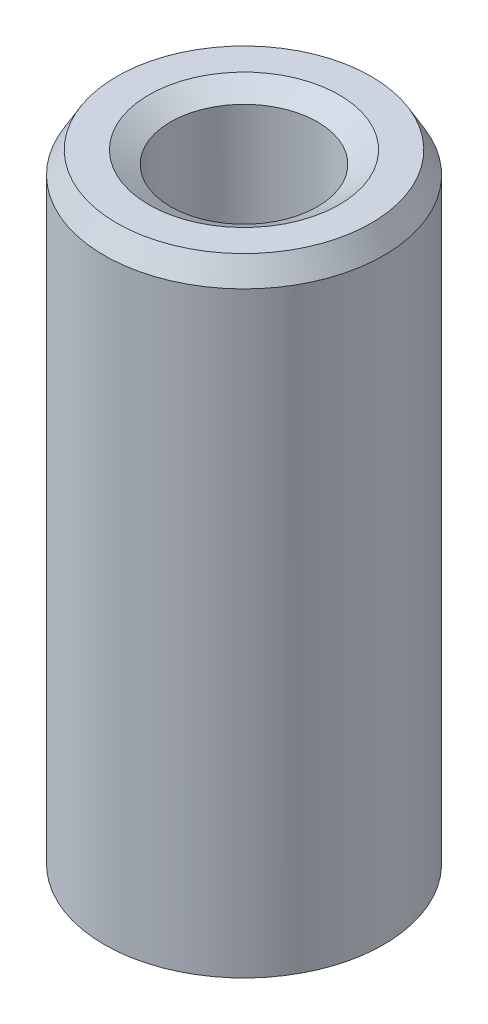
ISO-10303-21;
HEADER;
FILE_DESCRIPTION(('STEP AP214'),'2;1');
FILE_NAME('part.step','',(''),(''),'','','');
FILE_SCHEMA(('AUTOMOTIVE_DESIGN { 1 0 10303 214 1 1 1 1 }'));
ENDSEC;
DATA;
#1=APPLICATION_CONTEXT('core data for automotive mechanical design processes');
#2=APPLICATION_PROTOCOL_DEFINITION('international standard','automotive_design',2000,#1);
#3=PRODUCT_CONTEXT('',#1,'mechanical');
#4=PRODUCT('Part','Part','',(#3));
#5=PRODUCT_RELATED_PRODUCT_CATEGORY('part','',(#4));
#6=PRODUCT_DEFINITION_FORMATION('','',#4);
#7=PRODUCT_DEFINITION_CONTEXT('part definition',#1,'design');
#8=PRODUCT_DEFINITION('design','',#6,#7);
#9=PRODUCT_DEFINITION_SHAPE('','',#8);
#10=(LENGTH_UNIT() NAMED_UNIT(*) SI_UNIT(.MILLI.,.METRE.));
#11=(NAMED_UNIT(*) PLANE_ANGLE_UNIT() SI_UNIT($,.RADIAN.));
#12=(NAMED_UNIT(*) SI_UNIT($,.STERADIAN.) SOLID_ANGLE_UNIT());
#13=UNCERTAINTY_MEASURE_WITH_UNIT(LENGTH_MEASURE(1.E-05),#10,'distance_accuracy_value','');
#14=(GEOMETRIC_REPRESENTATION_CONTEXT(3) GLOBAL_UNCERTAINTY_ASSIGNED_CONTEXT((#13)) GLOBAL_UNIT_ASSIGNED_CONTEXT((#10,
#11,#12)) REPRESENTATION_CONTEXT('',''));
#15=CARTESIAN_POINT('',(0.,0.,0.));
#16=DIRECTION('',(0.,0.,1.));
#17=DIRECTION('',(1.,0.,0.));
#18=AXIS2_PLACEMENT_3D('',#15,#16,#17);
#19=CARTESIAN_POINT('',(0.,112.929822923321,0.));
#20=DIRECTION('',(0.,-1.,0.));
#21=DIRECTION('',(0.,0.,-1.));
#22=AXIS2_PLACEMENT_3D('',#19,#20,#21);
#23=CYLINDRICAL_SURFACE('',#22,25.);
#24=CARTESIAN_POINT('',(0.,2.24499833424635,0.));
#25=DIRECTION('',(0.,1.,0.));
#26=DIRECTION('',(0.,0.,1.));
#27=AXIS2_PLACEMENT_3D('',#24,#25,#26);
#28=CIRCLE('',#27,25.);
#29=CARTESIAN_POINT('',(0.,2.24499833424634,-25.));
#30=VERTEX_POINT('',#29);
#31=EDGE_CURVE('E10',#30,#30,#28,.T.);
#32=CARTESIAN_POINT('',(0.,109.041371745499,0.));
#33=DIRECTION('',(0.,1.,0.));
#34=DIRECTION('',(0.,0.,1.));
#35=AXIS2_PLACEMENT_3D('',#32,#33,#34);
#36=CIRCLE('',#35,25.);
#37=CARTESIAN_POINT('',(0.,109.041371745499,-25.));
#38=VERTEX_POINT('',#37);
#39=EDGE_CURVE('E50',#38,#38,#36,.F.);
#40=CARTESIAN_POINT('',(0.,2.24499833424634,-25.));
#41=CARTESIAN_POINT('',(0.,3.35746055728022,-25.));
#42=CARTESIAN_POINT('',(0.,4.4699227803141,-25.));
#43=CARTESIAN_POINT('',(0.,6.69484722638187,-25.));
#44=CARTESIAN_POINT('',(0.,7.80730944941575,-25.));
#45=CARTESIAN_POINT('',(0.,10.0322338954835,-25.));
#46=CARTESIAN_POINT('',(0.,11.1446961185174,-25.));
#47=CARTESIAN_POINT('',(0.,13.3696205645852,-25.));
#48=CARTESIAN_POINT('',(0.,14.482082787619,-25.));
#49=CARTESIAN_POINT('',(0.,16.7070072336868,-25.));
#50=CARTESIAN_POINT('',(0.,17.8194694567207,-25.));
#51=CARTESIAN_POINT('',(0.,20.0443939027885,-25.));
#52=CARTESIAN_POINT('',(0.,21.1568561258223,-25.));
#53=CARTESIAN_POINT('',(0.,23.3817805718901,-25.));
#54=CARTESIAN_POINT('',(0.,24.494242794924,-25.));
#55=CARTESIAN_POINT('',(0.,26.7191672409918,-25.));
#56=CARTESIAN_POINT('',(0.,27.8316294640256,-25.));
#57=CARTESIAN_POINT('',(0.,30.0565539100934,-25.));
#58=CARTESIAN_POINT('',(0.,31.1690161331273,-25.));
#59=CARTESIAN_POINT('',(0.,33.3939405791951,-25.));
#60=CARTESIAN_POINT('',(0.,34.5064028022289,-25.));
#61=CARTESIAN_POINT('',(0.,36.7313272482967,-25.));
#62=CARTESIAN_POINT('',(0.,37.8437894713306,-25.));
#63=CARTESIAN_POINT('',(0.,40.0687139173983,-25.));
#64=CARTESIAN_POINT('',(0.,41.1811761404322,-25.));
#65=CARTESIAN_POINT('',(0.,43.4061005865,-25.));
#66=CARTESIAN_POINT('',(0.,44.5185628095339,-25.));
#67=CARTESIAN_POINT('',(0.,46.7434872556016,-25.));
#68=CARTESIAN_POINT('',(0.,47.8559494786355,-25.));
#69=CARTESIAN_POINT('',(0.,50.0808739247033,-25.));
#70=CARTESIAN_POINT('',(0.,51.1933361477372,-25.));
#71=CARTESIAN_POINT('',(0.,53.4182605938049,-25.));
#72=CARTESIAN_POINT('',(0.,54.5307228168388,-25.));
#73=CARTESIAN_POINT('',(0.,56.7556472629066,-25.));
#74=CARTESIAN_POINT('',(0.,57.8681094859405,-25.));
#75=CARTESIAN_POINT('',(0.,60.0930339320082,-25.));
#76=CARTESIAN_POINT('',(0.,61.2054961550421,-25.));
#77=CARTESIAN_POINT('',(0.,63.4304206011099,-25.));
#78=CARTESIAN_POINT('',(0.,64.5428828241437,-25.));
#79=CARTESIAN_POINT('',(0.,66.7678072702115,-25.));
#80=CARTESIAN_POINT('',(0.,67.8802694932454,-25.));
#81=CARTESIAN_POINT('',(0.,70.1051939393132,-25.));
#82=CARTESIAN_POINT('',(0.,71.217656162347,-25.));
#83=CARTESIAN_POINT('',(0.,73.4425806084148,-25.));
#84=CARTESIAN_POINT('',(0.,74.5550428314487,-25.));
#85=CARTESIAN_POINT('',(0.,76.7799672775165,-25.));
#86=CARTESIAN_POINT('',(0.,77.8924295005503,-25.));
#87=CARTESIAN_POINT('',(0.,80.1173539466181,-25.));
#88=CARTESIAN_POINT('',(0.,81.229816169652,-25.));
#89=CARTESIAN_POINT('',(0.,83.4547406157198,-25.));
#90=CARTESIAN_POINT('',(0.,84.5672028387536,-25.));
#91=CARTESIAN_POINT('',(0.,86.7921272848214,-25.));
#92=CARTESIAN_POINT('',(0.,87.9045895078553,-25.));
#93=CARTESIAN_POINT('',(0.,90.1295139539231,-25.));
#94=CARTESIAN_POINT('',(0.,91.2419761769569,-25.));
#95=CARTESIAN_POINT('',(0.,93.4669006230247,-25.));
#96=CARTESIAN_POINT('',(0.,94.5793628460586,-25.));
#97=CARTESIAN_POINT('',(0.,96.8042872921263,-25.));
#98=CARTESIAN_POINT('',(0.,97.9167495151602,-25.));
#99=CARTESIAN_POINT('',(0.,100.141673961228,-25.));
#100=CARTESIAN_POINT('',(0.,101.254136184262,-25.));
#101=CARTESIAN_POINT('',(0.,103.47906063033,-25.));
#102=CARTESIAN_POINT('',(0.,104.591522853364,-25.));
#103=CARTESIAN_POINT('',(0.,106.816447299431,-25.));
#104=CARTESIAN_POINT('',(0.,107.928909522465,-25.));
#105=CARTESIAN_POINT('',(0.,109.041371745499,-25.));
#106=B_SPLINE_CURVE_WITH_KNOTS('',3,(#40,#41,#42,#43,#44,#45,#46,#47,#48,#49,#50,#51,#52,#53,
#54,#55,#56,#57,#58,#59,#60,#61,#62,#63,#64,#65,#66,#67,#68,#69,#70,#71,#72,#73,#74,#75,#76,#77,
#78,#79,#80,#81,#82,#83,#84,#85,#86,#87,#88,#89,#90,#91,#92,#93,#94,#95,#96,#97,#98,#99,#100,
#101,#102,#103,#104,#105),.UNSPECIFIED.,.F.,.F.,(4,2,2,2,2,2,2,2,2,2,2,2,2,2,2,2,2,2,2,2,2,2,2,
2,2,2,2,2,2,2,2,2,4),(0.,3.33738666910165,6.67477333820329,10.0121600073049,13.3495466764066,
16.6869333455082,20.0243200146099,23.3617066837115,26.6990933528132,30.0364800219148,
33.3738666910165,36.7112533601181,40.0486400292198,43.3860266983214,46.7234133674231,
50.0608000365247,53.3981867056264,56.735573374728,60.0729600438297,63.4103467129313,
66.7477333820329,70.0851200511346,73.4225067202362,76.7598933893379,80.0972800584395,
83.4346667275412,86.7720533966428,90.1094400657445,93.4468267348461,96.7842134039478,
100.121600073049,103.458986742151,106.796373411253),.UNSPECIFIED.);
#107=EDGE_CURVE('BSEAM39',#30,#38,#106,.T.);
#108=ORIENTED_EDGE('',*,*,#31,.T.);
#109=ORIENTED_EDGE('',*,*,#39,.T.);
#110=ORIENTED_EDGE('',*,*,#107,.T.);
#111=ORIENTED_EDGE('',*,*,#107,.F.);
#112=EDGE_LOOP('',(#108,#110,#109,#111));
#113=FACE_BOUND('',#112,.T.);
#114=ADVANCED_FACE('F39',(#113),#23,.T.);
#115=CARTESIAN_POINT('',(0.,112.929822923321,0.));
#116=DIRECTION('',(0.,1.,0.));
#117=DIRECTION('',(0.,0.,1.));
#118=AXIS2_PLACEMENT_3D('',#115,#116,#117);
#119=PLANE('',#118);
#120=CARTESIAN_POINT('',(0.,112.929822923321,0.));
#121=DIRECTION('',(0.,1.,0.));
#122=DIRECTION('',(0.,0.,1.));
#123=AXIS2_PLACEMENT_3D('',#120,#121,#122);
#124=CIRCLE('',#123,17.0359666515622);
#125=CARTESIAN_POINT('',(0.,112.929822923321,17.0359666515622));
#126=VERTEX_POINT('',#125);
#127=EDGE_CURVE('E58',#126,#126,#124,.F.);
#128=ORIENTED_EDGE('',*,*,#127,.T.);
#129=EDGE_LOOP('',(#128));
#130=FACE_BOUND('',#129,.T.);
#131=CARTESIAN_POINT('',(0.,112.929822923321,0.));
#132=DIRECTION('',(0.,1.,0.));
#133=DIRECTION('',(0.,0.,1.));
#134=AXIS2_PLACEMENT_3D('',#131,#132,#133);
#135=CIRCLE('',#134,22.7550016657538);
#136=CARTESIAN_POINT('',(0.,112.929822923321,22.7550016657538));
#137=VERTEX_POINT('',#136);
#138=EDGE_CURVE('E61',#137,#137,#135,.T.);
#139=ORIENTED_EDGE('',*,*,#138,.T.);
#140=EDGE_LOOP('',(#139));
#141=FACE_BOUND('',#140,.T.);
#142=ADVANCED_FACE('F88',(#130,#141),#119,.T.);
#143=CARTESIAN_POINT('',(0.,0.,0.));
#144=DIRECTION('',(0.,1.,0.));
#145=DIRECTION('',(0.,0.,1.));
#146=AXIS2_PLACEMENT_3D('',#143,#144,#145);
#147=PLANE('',#146);
#148=CARTESIAN_POINT('',(0.,0.,0.));
#149=DIRECTION('',(0.,1.,0.));
#150=DIRECTION('',(0.,0.,1.));
#151=AXIS2_PLACEMENT_3D('',#148,#149,#150);
#152=CIRCLE('',#151,15.3925138079863);
#153=CARTESIAN_POINT('',(0.,0.,15.3925138079863));
#154=VERTEX_POINT('',#153);
#155=EDGE_CURVE('E51',#154,#154,#152,.T.);
#156=ORIENTED_EDGE('',*,*,#155,.T.);
#157=EDGE_LOOP('',(#156));
#158=FACE_BOUND('',#157,.T.);
#159=CARTESIAN_POINT('',(0.,0.,0.));
#160=DIRECTION('',(0.,1.,0.));
#161=DIRECTION('',(0.,0.,1.));
#162=AXIS2_PLACEMENT_3D('',#159,#160,#161);
#163=CIRCLE('',#162,21.1115488221778);
#164=CARTESIAN_POINT('',(0.,0.,21.1115488221778));
#165=VERTEX_POINT('',#164);
#166=EDGE_CURVE('E54',#165,#165,#163,.F.);
#167=ORIENTED_EDGE('',*,*,#166,.T.);
#168=EDGE_LOOP('',(#167));
#169=FACE_BOUND('',#168,.T.);
#170=ADVANCED_FACE('F83',(#158,#169),#147,.F.);
#171=CARTESIAN_POINT('',(0.,112.929822923321,0.));
#172=DIRECTION('',(0.,-1.,0.));
#173=DIRECTION('',(0.,0.,-1.));
#174=AXIS2_PLACEMENT_3D('',#171,#172,#173);
#175=CYLINDRICAL_SURFACE('',#174,13.14751547374);
#176=CARTESIAN_POINT('',(0.,110.684824589075,0.));
#177=DIRECTION('',(0.,1.,0.));
#178=DIRECTION('',(0.,0.,1.));
#179=AXIS2_PLACEMENT_3D('',#176,#177,#178);
#180=CIRCLE('',#179,13.14751547374);
#181=CARTESIAN_POINT('',(0.,110.684824589075,-13.14751547374));
#182=VERTEX_POINT('',#181);
#183=EDGE_CURVE('E67',#182,#182,#180,.T.);
#184=CARTESIAN_POINT('',(0.,3.88845117782216,0.));
#185=DIRECTION('',(0.,1.,0.));
#186=DIRECTION('',(0.,0.,1.));
#187=AXIS2_PLACEMENT_3D('',#184,#185,#186);
#188=CIRCLE('',#187,13.14751547374);
#189=CARTESIAN_POINT('',(0.,3.88845117782215,-13.14751547374));
#190=VERTEX_POINT('',#189);
#191=EDGE_CURVE('E69',#190,#190,#188,.F.);
#192=CARTESIAN_POINT('',(0.,110.684824589075,-13.14751547374));
#193=CARTESIAN_POINT('',(0.,109.572362366041,-13.14751547374));
#194=CARTESIAN_POINT('',(0.,108.459900143007,-13.14751547374));
#195=CARTESIAN_POINT('',(0.,106.234975696939,-13.14751547374));
#196=CARTESIAN_POINT('',(0.,105.122513473905,-13.14751547374));
#197=CARTESIAN_POINT('',(0.,102.897589027838,-13.14751547374));
#198=CARTESIAN_POINT('',(0.,101.785126804804,-13.14751547374));
#199=CARTESIAN_POINT('',(0.,99.5602023587359,-13.14751547374));
#200=CARTESIAN_POINT('',(0.,98.447740135702,-13.14751547374));
#201=CARTESIAN_POINT('',(0.,96.2228156896343,-13.14751547374));
#202=CARTESIAN_POINT('',(0.,95.1103534666004,-13.14751547374));
#203=CARTESIAN_POINT('',(0.,92.8854290205326,-13.14751547374));
#204=CARTESIAN_POINT('',(0.,91.7729667974987,-13.14751547374));
#205=CARTESIAN_POINT('',(0.,89.548042351431,-13.14751547374));
#206=CARTESIAN_POINT('',(0.,88.4355801283971,-13.14751547374));
#207=CARTESIAN_POINT('',(0.,86.2106556823293,-13.14751547374));
#208=CARTESIAN_POINT('',(0.,85.0981934592954,-13.14751547374));
#209=CARTESIAN_POINT('',(0.,82.8732690132277,-13.14751547374));
#210=CARTESIAN_POINT('',(0.,81.7608067901938,-13.14751547374));
#211=CARTESIAN_POINT('',(0.,79.535882344126,-13.14751547374));
#212=CARTESIAN_POINT('',(0.,78.4234201210922,-13.14751547374));
#213=CARTESIAN_POINT('',(0.,76.1984956750244,-13.14751547374));
#214=CARTESIAN_POINT('',(0.,75.0860334519905,-13.14751547374));
#215=CARTESIAN_POINT('',(0.,72.8611090059228,-13.14751547374));
#216=CARTESIAN_POINT('',(0.,71.7486467828889,-13.14751547374));
#217=CARTESIAN_POINT('',(0.,69.5237223368211,-13.14751547374));
#218=CARTESIAN_POINT('',(0.,68.4112601137872,-13.14751547374));
#219=CARTESIAN_POINT('',(0.,66.1863356677195,-13.14751547374));
#220=CARTESIAN_POINT('',(0.,65.0738734446856,-13.14751547374));
#221=CARTESIAN_POINT('',(0.,62.8489489986178,-13.14751547374));
#222=CARTESIAN_POINT('',(0.,61.7364867755839,-13.14751547374));
#223=CARTESIAN_POINT('',(0.,59.5115623295162,-13.14751547374));
#224=CARTESIAN_POINT('',(0.,58.3991001064823,-13.14751547374));
#225=CARTESIAN_POINT('',(0.,56.1741756604145,-13.14751547374));
#226=CARTESIAN_POINT('',(0.,55.0617134373807,-13.14751547374));
#227=CARTESIAN_POINT('',(0.,52.8367889913129,-13.14751547374));
#228=CARTESIAN_POINT('',(0.,51.724326768279,-13.14751547374));
#229=CARTESIAN_POINT('',(0.,49.4994023222113,-13.14751547374));
#230=CARTESIAN_POINT('',(0.,48.3869400991774,-13.14751547374));
#231=CARTESIAN_POINT('',(0.,46.1620156531096,-13.14751547374));
#232=CARTESIAN_POINT('',(0.,45.0495534300757,-13.14751547374));
#233=CARTESIAN_POINT('',(0.,42.824628984008,-13.14751547374));
#234=CARTESIAN_POINT('',(0.,41.7121667609741,-13.14751547374));
#235=CARTESIAN_POINT('',(0.,39.4872423149063,-13.14751547374));
#236=CARTESIAN_POINT('',(0.,38.3747800918725,-13.14751547374));
#237=CARTESIAN_POINT('',(0.,36.1498556458047,-13.14751547374));
#238=CARTESIAN_POINT('',(0.,35.0373934227708,-13.14751547374));
#239=CARTESIAN_POINT('',(0.,32.8124689767031,-13.14751547374));
#240=CARTESIAN_POINT('',(0.,31.7000067536692,-13.14751547374));
#241=CARTESIAN_POINT('',(0.,29.4750823076014,-13.14751547374));
#242=CARTESIAN_POINT('',(0.,28.3626200845675,-13.14751547374));
#243=CARTESIAN_POINT('',(0.,26.1376956384998,-13.14751547374));
#244=CARTESIAN_POINT('',(0.,25.0252334154659,-13.14751547374));
#245=CARTESIAN_POINT('',(0.,22.8003089693981,-13.14751547374));
#246=CARTESIAN_POINT('',(0.,21.6878467463642,-13.14751547374));
#247=CARTESIAN_POINT('',(0.,19.4629223002965,-13.14751547374));
#248=CARTESIAN_POINT('',(0.,18.3504600772626,-13.14751547374));
#249=CARTESIAN_POINT('',(0.,16.1255356311948,-13.14751547374));
#250=CARTESIAN_POINT('',(0.,15.013073408161,-13.14751547374));
#251=CARTESIAN_POINT('',(0.,12.7881489620932,-13.14751547374));
#252=CARTESIAN_POINT('',(0.,11.6756867390593,-13.14751547374));
#253=CARTESIAN_POINT('',(0.,9.45076229299156,-13.14751547374));
#254=CARTESIAN_POINT('',(0.,8.33830006995769,-13.14751547374));
#255=CARTESIAN_POINT('',(0.,6.11337562388992,-13.14751547374));
#256=CARTESIAN_POINT('',(0.,5.00091340085603,-13.14751547374));
#257=CARTESIAN_POINT('',(0.,3.88845117782215,-13.14751547374));
#258=B_SPLINE_CURVE_WITH_KNOTS('',3,(#192,#193,#194,#195,#196,#197,#198,#199,#200,#201,#202,
#203,#204,#205,#206,#207,#208,#209,#210,#211,#212,#213,#214,#215,#216,#217,#218,#219,#220,#221,
#222,#223,#224,#225,#226,#227,#228,#229,#230,#231,#232,#233,#234,#235,#236,#237,#238,#239,#240,
#241,#242,#243,#244,#245,#246,#247,#248,#249,#250,#251,#252,#253,#254,#255,#256,#257),
.UNSPECIFIED.,.F.,.F.,(4,2,2,2,2,2,2,2,2,2,2,2,2,2,2,2,2,2,2,2,2,2,2,2,2,2,2,2,2,2,2,2,4),(0.,
3.33738666910165,6.67477333820329,10.0121600073049,13.3495466764066,16.6869333455082,
20.0243200146099,23.3617066837115,26.6990933528131,30.0364800219148,33.3738666910164,
36.7112533601181,40.0486400292197,43.3860266983214,46.723413367423,50.0608000365246,
53.3981867056263,56.7355733747279,60.0729600438296,63.4103467129312,66.7477333820328,
70.0851200511345,73.4225067202361,76.7598933893378,80.0972800584394,83.434666727541,
86.7720533966427,90.1094400657443,93.446826734846,96.7842134039476,100.121600073049,
103.458986742151,106.796373411253),.UNSPECIFIED.);
#259=EDGE_CURVE('BSEAM71',#182,#190,#258,.T.);
#260=ORIENTED_EDGE('',*,*,#183,.T.);
#261=ORIENTED_EDGE('',*,*,#191,.T.);
#262=ORIENTED_EDGE('',*,*,#259,.T.);
#263=ORIENTED_EDGE('',*,*,#259,.F.);
#264=EDGE_LOOP('',(#260,#262,#261,#263));
#265=FACE_BOUND('',#264,.T.);
#266=ADVANCED_FACE('F71',(#265),#175,.F.);
#267=CARTESIAN_POINT('',(0.,110.684824589075,0.));
#268=DIRECTION('',(0.,1.,0.));
#269=DIRECTION('',(0.,0.,1.));
#270=AXIS2_PLACEMENT_3D('',#267,#268,#269);
#271=CONICAL_SURFACE('',#270,13.14751547374,1.0471975511966);
#272=ORIENTED_EDGE('',*,*,#127,.F.);
#273=EDGE_LOOP('',(#272));
#274=FACE_BOUND('',#273,.T.);
#275=ORIENTED_EDGE('',*,*,#183,.F.);
#276=EDGE_LOOP('',(#275));
#277=FACE_BOUND('',#276,.T.);
#278=ADVANCED_FACE('F77',(#274,#277),#271,.F.);
#279=CARTESIAN_POINT('',(0.,0.,0.));
#280=DIRECTION('',(0.,-1.,0.));
#281=DIRECTION('',(0.,0.,-1.));
#282=AXIS2_PLACEMENT_3D('',#279,#280,#281);
#283=CONICAL_SURFACE('',#282,15.3925138079863,0.523598775598293);
#284=ORIENTED_EDGE('',*,*,#191,.F.);
#285=EDGE_LOOP('',(#284));
#286=FACE_BOUND('',#285,.T.);
#287=ORIENTED_EDGE('',*,*,#155,.F.);
#288=EDGE_LOOP('',(#287));
#289=FACE_BOUND('',#288,.T.);
#290=ADVANCED_FACE('F73',(#286,#289),#283,.F.);
#291=CARTESIAN_POINT('',(0.,2.24499833424635,0.));
#292=DIRECTION('',(0.,1.,0.));
#293=DIRECTION('',(0.,0.,1.));
#294=AXIS2_PLACEMENT_3D('',#291,#292,#293);
#295=CONICAL_SURFACE('',#294,25.,1.0471975511966);
#296=ORIENTED_EDGE('',*,*,#166,.F.);
#297=EDGE_LOOP('',(#296));
#298=FACE_BOUND('',#297,.T.);
#299=ORIENTED_EDGE('',*,*,#31,.F.);
#300=EDGE_LOOP('',(#299));
#301=FACE_BOUND('',#300,.T.);
#302=ADVANCED_FACE('F76',(#298,#301),#295,.T.);
#303=CARTESIAN_POINT('',(0.,112.929822923321,0.));
#304=DIRECTION('',(0.,-1.,0.));
#305=DIRECTION('',(0.,0.,-1.));
#306=AXIS2_PLACEMENT_3D('',#303,#304,#305);
#307=CONICAL_SURFACE('',#306,22.7550016657538,0.523598775598297);
#308=ORIENTED_EDGE('',*,*,#39,.F.);
#309=EDGE_LOOP('',(#308));
#310=FACE_BOUND('',#309,.T.);
#311=ORIENTED_EDGE('',*,*,#138,.F.);
#312=EDGE_LOOP('',(#311));
#313=FACE_BOUND('',#312,.T.);
#314=ADVANCED_FACE('F45',(#310,#313),#307,.T.);
#315=CLOSED_SHELL('',(#114,#142,#170,#266,#278,#290,#302,#314));
#316=MANIFOLD_SOLID_BREP('B2',#315);
#317=ADVANCED_BREP_SHAPE_REPRESENTATION('',(#18,#316),#14);
#318=SHAPE_DEFINITION_REPRESENTATION(#9,#317);
ENDSEC;
END-ISO-10303-21;
